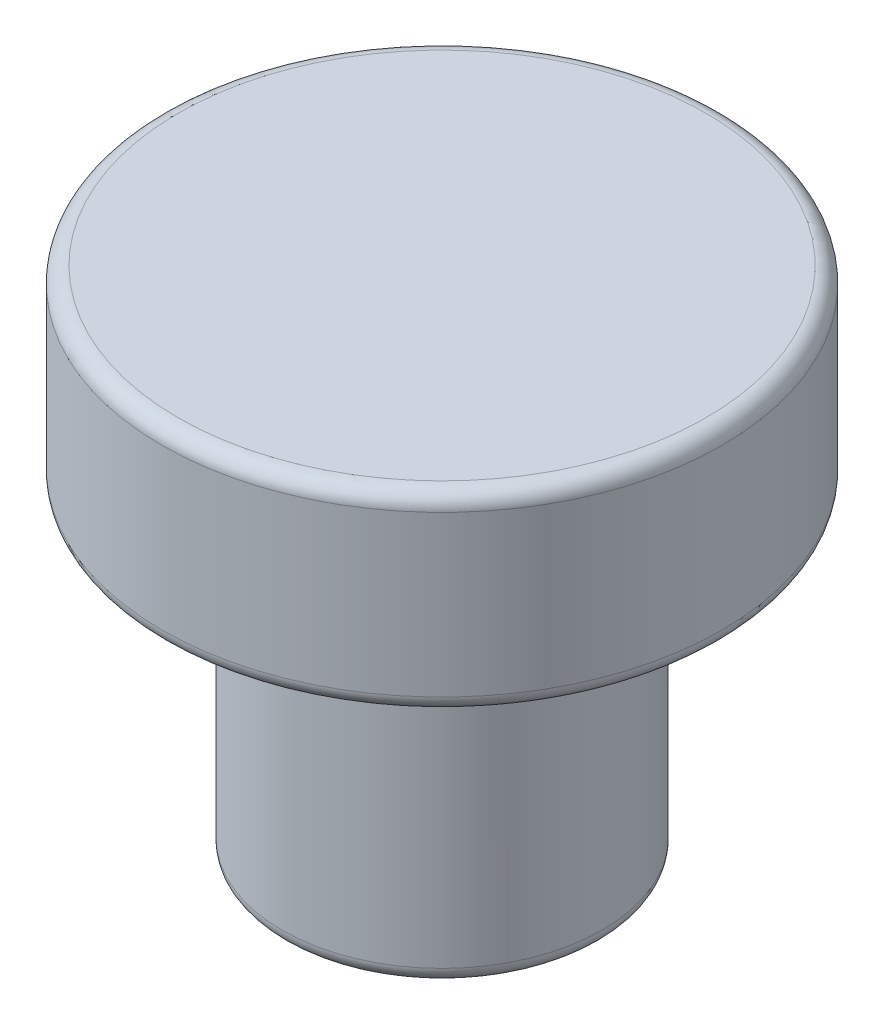
ISO-10303-21;
HEADER;
FILE_DESCRIPTION(('STEP AP214'),'2;1');
FILE_NAME('part.step','',(''),(''),'','','');
FILE_SCHEMA(('AUTOMOTIVE_DESIGN { 1 0 10303 214 1 1 1 1 }'));
ENDSEC;
DATA;
#1=APPLICATION_CONTEXT('core data for automotive mechanical design processes');
#2=APPLICATION_PROTOCOL_DEFINITION('international standard','automotive_design',2000,#1);
#3=PRODUCT_CONTEXT('',#1,'mechanical');
#4=PRODUCT('Part','Part','',(#3));
#5=PRODUCT_RELATED_PRODUCT_CATEGORY('part','',(#4));
#6=PRODUCT_DEFINITION_FORMATION('','',#4);
#7=PRODUCT_DEFINITION_CONTEXT('part definition',#1,'design');
#8=PRODUCT_DEFINITION('design','',#6,#7);
#9=PRODUCT_DEFINITION_SHAPE('','',#8);
#10=(LENGTH_UNIT() NAMED_UNIT(*) SI_UNIT(.MILLI.,.METRE.));
#11=(NAMED_UNIT(*) PLANE_ANGLE_UNIT() SI_UNIT($,.RADIAN.));
#12=(NAMED_UNIT(*) SI_UNIT($,.STERADIAN.) SOLID_ANGLE_UNIT());
#13=UNCERTAINTY_MEASURE_WITH_UNIT(LENGTH_MEASURE(1.E-05),#10,'distance_accuracy_value','');
#14=(GEOMETRIC_REPRESENTATION_CONTEXT(3) GLOBAL_UNCERTAINTY_ASSIGNED_CONTEXT((#13)) GLOBAL_UNIT_ASSIGNED_CONTEXT((#10,
#11,#12)) REPRESENTATION_CONTEXT('',''));
#15=CARTESIAN_POINT('',(0.,0.,0.));
#16=DIRECTION('',(0.,0.,1.));
#17=DIRECTION('',(1.,0.,0.));
#18=AXIS2_PLACEMENT_3D('',#15,#16,#17);
#19=CARTESIAN_POINT('',(0.,12.,0.));
#20=DIRECTION('',(0.,-1.,0.));
#21=DIRECTION('',(0.,0.,-1.));
#22=AXIS2_PLACEMENT_3D('',#19,#20,#21);
#23=CYLINDRICAL_SURFACE('',#22,17.5);
#24=CARTESIAN_POINT('',(0.,1.,0.));
#25=DIRECTION('',(0.,1.,0.));
#26=DIRECTION('',(0.,0.,1.));
#27=AXIS2_PLACEMENT_3D('',#24,#25,#26);
#28=CIRCLE('',#27,17.5);
#29=CARTESIAN_POINT('',(0.,1.,17.5));
#30=VERTEX_POINT('',#29);
#31=EDGE_CURVE('E38',#30,#30,#28,.T.);
#32=ORIENTED_EDGE('',*,*,#31,.T.);
#33=EDGE_LOOP('',(#32));
#34=FACE_BOUND('',#33,.T.);
#35=CARTESIAN_POINT('',(0.,11.,0.));
#36=DIRECTION('',(0.,1.,0.));
#37=DIRECTION('',(0.,0.,1.));
#38=AXIS2_PLACEMENT_3D('',#35,#36,#37);
#39=CIRCLE('',#38,17.5);
#40=CARTESIAN_POINT('',(0.,11.,17.5));
#41=VERTEX_POINT('',#40);
#42=EDGE_CURVE('E42',#41,#41,#39,.F.);
#43=ORIENTED_EDGE('',*,*,#42,.T.);
#44=EDGE_LOOP('',(#43));
#45=FACE_BOUND('',#44,.T.);
#46=ADVANCED_FACE('F31',(#34,#45),#23,.T.);
#47=CARTESIAN_POINT('',(0.,12.,0.));
#48=DIRECTION('',(0.,1.,0.));
#49=DIRECTION('',(0.,0.,1.));
#50=AXIS2_PLACEMENT_3D('',#47,#48,#49);
#51=PLANE('',#50);
#52=CARTESIAN_POINT('',(0.,12.,0.));
#53=DIRECTION('',(0.,1.,0.));
#54=DIRECTION('',(0.,0.,1.));
#55=AXIS2_PLACEMENT_3D('',#52,#53,#54);
#56=CIRCLE('',#55,16.5);
#57=CARTESIAN_POINT('',(0.,12.,16.5));
#58=VERTEX_POINT('',#57);
#59=EDGE_CURVE('E10',#58,#58,#56,.T.);
#60=ORIENTED_EDGE('',*,*,#59,.T.);
#61=EDGE_LOOP('',(#60));
#62=FACE_BOUND('',#61,.T.);
#63=ADVANCED_FACE('F83',(#62),#51,.T.);
#64=CARTESIAN_POINT('',(0.,0.,0.));
#65=DIRECTION('',(0.,1.,0.));
#66=DIRECTION('',(0.,0.,1.));
#67=AXIS2_PLACEMENT_3D('',#64,#65,#66);
#68=PLANE('',#67);
#69=CARTESIAN_POINT('',(0.,0.,0.));
#70=DIRECTION('',(0.,1.,0.));
#71=DIRECTION('',(0.,0.,1.));
#72=AXIS2_PLACEMENT_3D('',#69,#70,#71);
#73=CIRCLE('',#72,11.);
#74=CARTESIAN_POINT('',(0.,0.,11.));
#75=VERTEX_POINT('',#74);
#76=EDGE_CURVE('E46',#75,#75,#73,.T.);
#77=ORIENTED_EDGE('',*,*,#76,.T.);
#78=EDGE_LOOP('',(#77));
#79=FACE_BOUND('',#78,.T.);
#80=CARTESIAN_POINT('',(0.,0.,0.));
#81=DIRECTION('',(0.,1.,0.));
#82=DIRECTION('',(0.,0.,1.));
#83=AXIS2_PLACEMENT_3D('',#80,#81,#82);
#84=CIRCLE('',#83,16.5);
#85=CARTESIAN_POINT('',(0.,0.,16.5));
#86=VERTEX_POINT('',#85);
#87=EDGE_CURVE('E51',#86,#86,#84,.F.);
#88=ORIENTED_EDGE('',*,*,#87,.T.);
#89=EDGE_LOOP('',(#88));
#90=FACE_BOUND('',#89,.T.);
#91=ADVANCED_FACE('F87',(#79,#90),#68,.F.);
#92=CARTESIAN_POINT('',(0.,-20.,0.));
#93=DIRECTION('',(0.,1.,0.));
#94=DIRECTION('',(0.,0.,1.));
#95=AXIS2_PLACEMENT_3D('',#92,#93,#94);
#96=CYLINDRICAL_SURFACE('',#95,10.);
#97=CARTESIAN_POINT('',(0.,-19.,0.));
#98=DIRECTION('',(0.,-1.,0.));
#99=DIRECTION('',(0.,0.,-1.));
#100=AXIS2_PLACEMENT_3D('',#97,#98,#99);
#101=CIRCLE('',#100,10.);
#102=CARTESIAN_POINT('',(0.,-19.,-10.));
#103=VERTEX_POINT('',#102);
#104=EDGE_CURVE('E54',#103,#103,#101,.F.);
#105=ORIENTED_EDGE('',*,*,#104,.T.);
#106=EDGE_LOOP('',(#105));
#107=FACE_BOUND('',#106,.T.);
#108=CARTESIAN_POINT('',(0.,-1.,0.));
#109=DIRECTION('',(0.,1.,0.));
#110=DIRECTION('',(0.,0.,1.));
#111=AXIS2_PLACEMENT_3D('',#108,#109,#110);
#112=CIRCLE('',#111,10.);
#113=CARTESIAN_POINT('',(0.,-1.,10.));
#114=VERTEX_POINT('',#113);
#115=EDGE_CURVE('E57',#114,#114,#112,.F.);
#116=ORIENTED_EDGE('',*,*,#115,.T.);
#117=EDGE_LOOP('',(#116));
#118=FACE_BOUND('',#117,.T.);
#119=ADVANCED_FACE('F78',(#107,#118),#96,.T.);
#120=CARTESIAN_POINT('',(0.,-20.,0.));
#121=DIRECTION('',(0.,-1.,0.));
#122=DIRECTION('',(0.,0.,-1.));
#123=AXIS2_PLACEMENT_3D('',#120,#121,#122);
#124=PLANE('',#123);
#125=CARTESIAN_POINT('',(0.,-20.,0.));
#126=DIRECTION('',(0.,-1.,0.));
#127=DIRECTION('',(0.,0.,-1.));
#128=AXIS2_PLACEMENT_3D('',#125,#126,#127);
#129=CIRCLE('',#128,9.);
#130=CARTESIAN_POINT('',(0.,-20.,-9.));
#131=VERTEX_POINT('',#130);
#132=EDGE_CURVE('E60',#131,#131,#129,.T.);
#133=ORIENTED_EDGE('',*,*,#132,.T.);
#134=EDGE_LOOP('',(#133));
#135=FACE_BOUND('',#134,.T.);
#136=ADVANCED_FACE('F64',(#135),#124,.T.);
#137=CARTESIAN_POINT('',(0.,-19.,0.));
#138=DIRECTION('',(0.,-1.,0.));
#139=DIRECTION('',(0.,0.,-1.));
#140=AXIS2_PLACEMENT_3D('',#137,#138,#139);
#141=TOROIDAL_SURFACE('',#140,9.,1.);
#142=ORIENTED_EDGE('',*,*,#104,.F.);
#143=EDGE_LOOP('',(#142));
#144=FACE_BOUND('',#143,.T.);
#145=ORIENTED_EDGE('',*,*,#132,.F.);
#146=EDGE_LOOP('',(#145));
#147=FACE_BOUND('',#146,.T.);
#148=ADVANCED_FACE('F66',(#144,#147),#141,.T.);
#149=CARTESIAN_POINT('',(0.,-1.,0.));
#150=DIRECTION('',(0.,1.,0.));
#151=DIRECTION('',(0.,0.,1.));
#152=AXIS2_PLACEMENT_3D('',#149,#150,#151);
#153=TOROIDAL_SURFACE('',#152,11.,1.);
#154=ORIENTED_EDGE('',*,*,#76,.F.);
#155=EDGE_LOOP('',(#154));
#156=FACE_BOUND('',#155,.T.);
#157=ORIENTED_EDGE('',*,*,#115,.F.);
#158=EDGE_LOOP('',(#157));
#159=FACE_BOUND('',#158,.T.);
#160=ADVANCED_FACE('F68',(#156,#159),#153,.F.);
#161=CARTESIAN_POINT('',(0.,1.,0.));
#162=DIRECTION('',(0.,1.,0.));
#163=DIRECTION('',(0.,0.,1.));
#164=AXIS2_PLACEMENT_3D('',#161,#162,#163);
#165=TOROIDAL_SURFACE('',#164,16.5,1.);
#166=ORIENTED_EDGE('',*,*,#87,.F.);
#167=EDGE_LOOP('',(#166));
#168=FACE_BOUND('',#167,.T.);
#169=ORIENTED_EDGE('',*,*,#31,.F.);
#170=EDGE_LOOP('',(#169));
#171=FACE_BOUND('',#170,.T.);
#172=ADVANCED_FACE('F75',(#168,#171),#165,.T.);
#173=CARTESIAN_POINT('',(0.,11.,0.));
#174=DIRECTION('',(0.,1.,0.));
#175=DIRECTION('',(0.,0.,1.));
#176=AXIS2_PLACEMENT_3D('',#173,#174,#175);
#177=TOROIDAL_SURFACE('',#176,16.5,1.);
#178=ORIENTED_EDGE('',*,*,#42,.F.);
#179=EDGE_LOOP('',(#178));
#180=FACE_BOUND('',#179,.T.);
#181=ORIENTED_EDGE('',*,*,#59,.F.);
#182=EDGE_LOOP('',(#181));
#183=FACE_BOUND('',#182,.T.);
#184=ADVANCED_FACE('F33',(#180,#183),#177,.T.);
#185=CLOSED_SHELL('',(#46,#63,#91,#119,#136,#148,#160,#172,#184));
#186=MANIFOLD_SOLID_BREP('B2',#185);
#187=ADVANCED_BREP_SHAPE_REPRESENTATION('',(#18,#186),#14);
#188=SHAPE_DEFINITION_REPRESENTATION(#9,#187);
ENDSEC;
END-ISO-10303-21;
